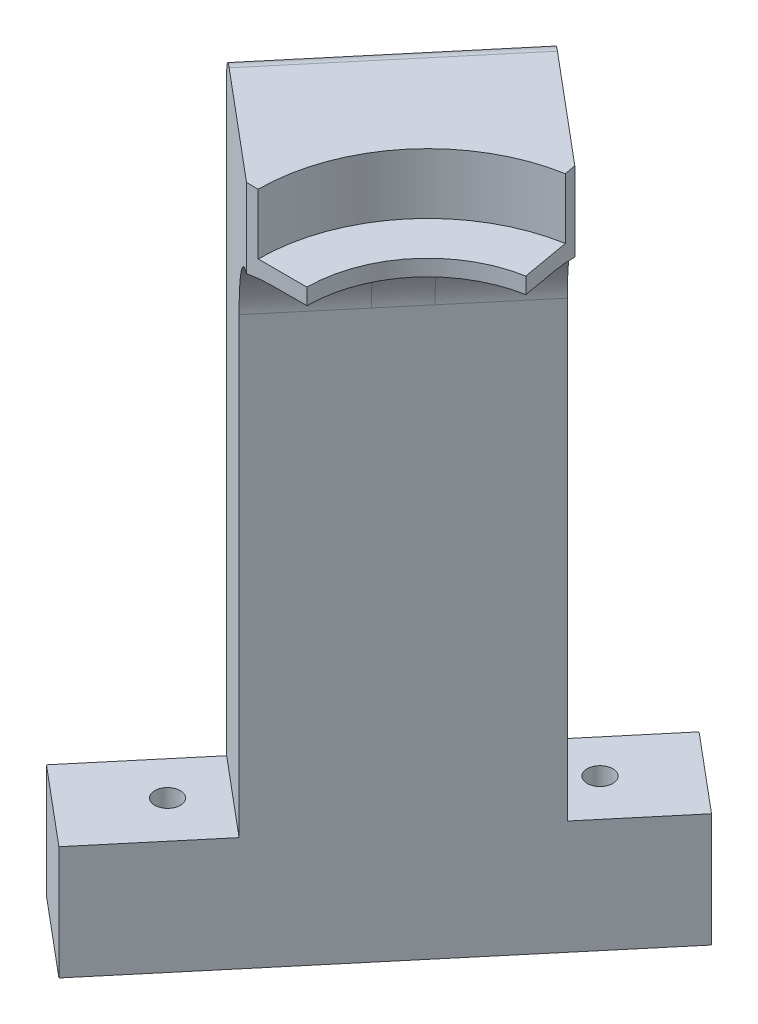
ISO-10303-21;
HEADER;
FILE_DESCRIPTION(('STEP AP214'),'2;1');
FILE_NAME('part.step','',(''),(''),'','','');
FILE_SCHEMA(('AUTOMOTIVE_DESIGN { 1 0 10303 214 1 1 1 1 }'));
ENDSEC;
DATA;
#1=APPLICATION_CONTEXT('core data for automotive mechanical design processes');
#2=APPLICATION_PROTOCOL_DEFINITION('international standard','automotive_design',2000,#1);
#3=PRODUCT_CONTEXT('',#1,'mechanical');
#4=PRODUCT('Part','Part','',(#3));
#5=PRODUCT_RELATED_PRODUCT_CATEGORY('part','',(#4));
#6=PRODUCT_DEFINITION_FORMATION('','',#4);
#7=PRODUCT_DEFINITION_CONTEXT('part definition',#1,'design');
#8=PRODUCT_DEFINITION('design','',#6,#7);
#9=PRODUCT_DEFINITION_SHAPE('','',#8);
#10=(LENGTH_UNIT() NAMED_UNIT(*) SI_UNIT(.MILLI.,.METRE.));
#11=(NAMED_UNIT(*) PLANE_ANGLE_UNIT() SI_UNIT($,.RADIAN.));
#12=(NAMED_UNIT(*) SI_UNIT($,.STERADIAN.) SOLID_ANGLE_UNIT());
#13=UNCERTAINTY_MEASURE_WITH_UNIT(LENGTH_MEASURE(1.E-05),#10,'distance_accuracy_value','');
#14=(GEOMETRIC_REPRESENTATION_CONTEXT(3) GLOBAL_UNCERTAINTY_ASSIGNED_CONTEXT((#13)) GLOBAL_UNIT_ASSIGNED_CONTEXT((#10,
#11,#12)) REPRESENTATION_CONTEXT('',''));
#15=CARTESIAN_POINT('',(0.,0.,0.));
#16=DIRECTION('',(0.,0.,1.));
#17=DIRECTION('',(1.,0.,0.));
#18=AXIS2_PLACEMENT_3D('',#15,#16,#17);
#19=CARTESIAN_POINT('',(34.9197212885323,0.,-41.6157032979967));
#20=DIRECTION('',(-0.642787609686541,0.,0.766044443118976));
#21=DIRECTION('',(0.766044443118976,0.,0.642787609686541));
#22=AXIS2_PLACEMENT_3D('',#19,#20,#21);
#23=PLANE('',#22);
#24=DIRECTION('',(-0.766044443118976,0.,-0.642787609686541));
#25=VECTOR('',#24,1.);
#26=CARTESIAN_POINT('',(-2.97802935575824,-132.425,-73.4156918860695));
#27=LINE('',#26,#25);
#28=CARTESIAN_POINT('',(-2.97802935575824,-132.425,-73.4156918860695));
#29=VERTEX_POINT('',#28);
#30=CARTESIAN_POINT('',(-22.1291404337327,-132.425,-89.4853821282331));
#31=VERTEX_POINT('',#30);
#32=EDGE_CURVE('E198',#29,#31,#27,.T.);
#33=ORIENTED_EDGE('',*,*,#32,.F.);
#34=DIRECTION('',(0.,-1.,0.));
#35=VECTOR('',#34,1.);
#36=CARTESIAN_POINT('',(-2.97802935575824,-103.5,-73.4156918860695));
#37=LINE('',#36,#35);
#38=CARTESIAN_POINT('',(-2.97802935575824,-160.65,-73.4156918860695));
#39=VERTEX_POINT('',#38);
#40=EDGE_CURVE('E250',#29,#39,#37,.T.);
#41=ORIENTED_EDGE('',*,*,#40,.T.);
#42=DIRECTION('',(0.766044443118976,0.,0.642787609686541));
#43=VECTOR('',#42,1.);
#44=CARTESIAN_POINT('',(-22.1291404337327,-160.65,-89.4853821282331));
#45=LINE('',#44,#43);
#46=CARTESIAN_POINT('',(-22.1291404337327,-160.65,-89.4853821282331));
#47=VERTEX_POINT('',#46);
#48=EDGE_CURVE('E236',#47,#39,#45,.T.);
#49=ORIENTED_EDGE('',*,*,#48,.F.);
#50=DIRECTION('',(0.,1.,0.));
#51=VECTOR('',#50,1.);
#52=CARTESIAN_POINT('',(-22.1291404337327,-103.5,-89.4853821282331));
#53=LINE('',#52,#51);
#54=EDGE_CURVE('E253',#47,#31,#53,.T.);
#55=ORIENTED_EDGE('',*,*,#54,.T.);
#56=EDGE_LOOP('',(#33,#41,#49,#55));
#57=FACE_BOUND('',#56,.T.);
#58=ADVANCED_FACE('F43',(#57),#23,.F.);
#59=CARTESIAN_POINT('',(-39.0014226100418,0.,46.4800855118022));
#60=DIRECTION('',(-0.642787609686541,0.,0.766044443118977));
#61=DIRECTION('',(0.766044443118977,0.,0.642787609686541));
#62=AXIS2_PLACEMENT_3D('',#59,#60,#61);
#63=PLANE('',#62);
#64=DIRECTION('',(0.,1.,0.));
#65=VECTOR('',#64,1.);
#66=CARTESIAN_POINT('',(-76.8991732543323,-103.5,14.6800969237294));
#67=LINE('',#66,#65);
#68=CARTESIAN_POINT('',(-76.8991732543323,-160.65,14.6800969237294));
#69=VERTEX_POINT('',#68);
#70=CARTESIAN_POINT('',(-76.8991732543323,-132.425,14.6800969237294));
#71=VERTEX_POINT('',#70);
#72=EDGE_CURVE('E247',#69,#71,#67,.T.);
#73=ORIENTED_EDGE('',*,*,#72,.T.);
#74=DIRECTION('',(0.766044443118977,0.,0.642787609686541));
#75=VECTOR('',#74,1.);
#76=CARTESIAN_POINT('',(-96.0502843323067,-132.425,-1.38959331843411));
#77=LINE('',#76,#75);
#78=CARTESIAN_POINT('',(-96.0502843323067,-132.425,-1.38959331843411));
#79=VERTEX_POINT('',#78);
#80=EDGE_CURVE('E192',#79,#71,#77,.T.);
#81=ORIENTED_EDGE('',*,*,#80,.F.);
#82=DIRECTION('',(0.,-1.,0.));
#83=VECTOR('',#82,1.);
#84=CARTESIAN_POINT('',(-96.0502843323067,-97.5,-1.38959331843411));
#85=LINE('',#84,#83);
#86=CARTESIAN_POINT('',(-96.0502843323067,-160.65,-1.38959331843411));
#87=VERTEX_POINT('',#86);
#88=EDGE_CURVE('E244',#79,#87,#85,.T.);
#89=ORIENTED_EDGE('',*,*,#88,.T.);
#90=DIRECTION('',(-0.766044443118977,0.,-0.642787609686541));
#91=VECTOR('',#90,1.);
#92=CARTESIAN_POINT('',(-76.8991732543323,-160.65,14.6800969237294));
#93=LINE('',#92,#91);
#94=EDGE_CURVE('E228',#69,#87,#93,.T.);
#95=ORIENTED_EDGE('',*,*,#94,.F.);
#96=EDGE_LOOP('',(#73,#81,#89,#95));
#97=FACE_BOUND('',#96,.T.);
#98=ADVANCED_FACE('F389',(#97),#63,.T.);
#99=CARTESIAN_POINT('',(-73.8894813564539,-78.1,-9.29198815349686));
#100=DIRECTION('',(0.,-1.,0.));
#101=DIRECTION('',(0.,0.,-1.));
#102=AXIS2_PLACEMENT_3D('',#99,#100,#101);
#103=CYLINDRICAL_SURFACE('',#102,3.175);
#104=CARTESIAN_POINT('',(-73.8894813564539,-160.65,-9.29198815349686));
#105=DIRECTION('',(0.,-1.,0.));
#106=DIRECTION('',(0.,0.,-1.));
#107=AXIS2_PLACEMENT_3D('',#104,#105,#106);
#108=CIRCLE('',#107,3.175);
#109=CARTESIAN_POINT('',(-73.8894813564539,-160.65,-12.4669881534969));
#110=VERTEX_POINT('',#109);
#111=EDGE_CURVE('E205',#110,#110,#108,.T.);
#112=ORIENTED_EDGE('',*,*,#111,.T.);
#113=EDGE_LOOP('',(#112));
#114=FACE_BOUND('',#113,.T.);
#115=CARTESIAN_POINT('',(-73.8894813564539,-132.425,-9.29198815349686));
#116=DIRECTION('',(0.,1.,0.));
#117=DIRECTION('',(0.,0.,1.));
#118=AXIS2_PLACEMENT_3D('',#115,#116,#117);
#119=CIRCLE('',#118,3.175);
#120=CARTESIAN_POINT('',(-73.8894813564539,-132.425,-6.11698815349686));
#121=VERTEX_POINT('',#120);
#122=EDGE_CURVE('E194',#121,#121,#119,.T.);
#123=ORIENTED_EDGE('',*,*,#122,.T.);
#124=EDGE_LOOP('',(#123));
#125=FACE_BOUND('',#124,.T.);
#126=ADVANCED_FACE('F395',(#114,#125),#103,.F.);
#127=CARTESIAN_POINT('',(-24.9090654983395,-78.1,-67.6645747191629));
#128=DIRECTION('',(0.,-1.,0.));
#129=DIRECTION('',(0.,0.,-1.));
#130=AXIS2_PLACEMENT_3D('',#127,#128,#129);
#131=CYLINDRICAL_SURFACE('',#130,3.175);
#132=CARTESIAN_POINT('',(-24.9090654983395,-160.65,-67.6645747191629));
#133=DIRECTION('',(0.,-1.,0.));
#134=DIRECTION('',(0.,0.,-1.));
#135=AXIS2_PLACEMENT_3D('',#132,#133,#134);
#136=CIRCLE('',#135,3.175);
#137=CARTESIAN_POINT('',(-24.9090654983395,-160.65,-70.8395747191629));
#138=VERTEX_POINT('',#137);
#139=EDGE_CURVE('E224',#138,#138,#136,.T.);
#140=ORIENTED_EDGE('',*,*,#139,.T.);
#141=EDGE_LOOP('',(#140));
#142=FACE_BOUND('',#141,.T.);
#143=CARTESIAN_POINT('',(-24.9090654983395,-132.425,-67.6645747191629));
#144=DIRECTION('',(0.,1.,0.));
#145=DIRECTION('',(0.,0.,1.));
#146=AXIS2_PLACEMENT_3D('',#143,#144,#145);
#147=CIRCLE('',#146,3.175);
#148=CARTESIAN_POINT('',(-24.9090654983395,-132.425,-64.4895747191629));
#149=VERTEX_POINT('',#148);
#150=EDGE_CURVE('E206',#149,#149,#147,.T.);
#151=ORIENTED_EDGE('',*,*,#150,.T.);
#152=EDGE_LOOP('',(#151));
#153=FACE_BOUND('',#152,.T.);
#154=ADVANCED_FACE('F560',(#142,#153),#131,.F.);
#155=CARTESIAN_POINT('',(0.,0.,0.));
#156=DIRECTION('',(0.,1.,0.));
#157=DIRECTION('',(0.,0.,1.));
#158=AXIS2_PLACEMENT_3D('',#155,#156,#157);
#159=PLANE('',#158);
#160=DIRECTION('',(-1.,0.,0.));
#161=VECTOR('',#160,1.);
#162=CARTESIAN_POINT('',(0.,0.,0.));
#163=LINE('',#162,#161);
#164=CARTESIAN_POINT('',(-30.,0.,0.));
#165=VERTEX_POINT('',#164);
#166=CARTESIAN_POINT('',(-38.4729635533386,0.,0.));
#167=VERTEX_POINT('',#166);
#168=EDGE_CURVE('E301',#165,#167,#163,.T.);
#169=ORIENTED_EDGE('',*,*,#168,.T.);
#170=DIRECTION('',(-0.642787609686541,0.,0.766044443118977));
#171=VECTOR('',#170,1.);
#172=CARTESIAN_POINT('',(-3.98394577941684,0.,-41.1024108371167));
#173=LINE('',#172,#171);
#174=CARTESIAN_POINT('',(-26.1788372794916,0.,-14.651569154664));
#175=VERTEX_POINT('',#174);
#176=EDGE_CURVE('E444',#167,#175,#173,.F.);
#177=ORIENTED_EDGE('',*,*,#176,.T.);
#178=CARTESIAN_POINT('',(0.,0.,0.));
#179=DIRECTION('',(0.,1.,0.));
#180=DIRECTION('',(0.,0.,1.));
#181=AXIS2_PLACEMENT_3D('',#178,#179,#180);
#182=CIRCLE('',#181,30.);
#183=EDGE_CURVE('E295',#175,#165,#182,.T.);
#184=ORIENTED_EDGE('',*,*,#183,.T.);
#185=EDGE_LOOP('',(#169,#177,#184));
#186=FACE_BOUND('',#185,.T.);
#187=ADVANCED_FACE('F469',(#186),#159,.F.);
#188=CARTESIAN_POINT('',(-5.20944533000783,0.,-29.5442325903663));
#189=VERTEX_POINT('',#188);
#190=CARTESIAN_POINT('',(-18.9748862843304,0.,-23.23690363402));
#191=VERTEX_POINT('',#190);
#192=EDGE_CURVE('E310',#189,#191,#182,.T.);
#193=ORIENTED_EDGE('',*,*,#192,.T.);
#194=DIRECTION('',(-0.642787609686541,0.,0.766044443118977));
#195=VECTOR('',#194,1.);
#196=CARTESIAN_POINT('',(-3.98394577941684,0.,-41.1024108371167));
#197=LINE('',#196,#195);
#198=CARTESIAN_POINT('',(-6.68076001048337,0.,-37.888472788684));
#199=VERTEX_POINT('',#198);
#200=EDGE_CURVE('E451',#191,#199,#197,.F.);
#201=ORIENTED_EDGE('',*,*,#200,.T.);
#202=DIRECTION('',(-0.173648177666928,0.,-0.984807753012209));
#203=VECTOR('',#202,1.);
#204=CARTESIAN_POINT('',(0.,0.,0.));
#205=LINE('',#204,#203);
#206=EDGE_CURVE('E314',#189,#199,#205,.T.);
#207=ORIENTED_EDGE('',*,*,#206,.F.);
#208=EDGE_LOOP('',(#193,#201,#207));
#209=FACE_BOUND('',#208,.T.);
#210=ADVANCED_FACE('F463',(#209),#159,.F.);
#211=CARTESIAN_POINT('',(0.,4.,0.));
#212=DIRECTION('',(0.,1.,0.));
#213=DIRECTION('',(0.,0.,1.));
#214=AXIS2_PLACEMENT_3D('',#211,#212,#213);
#215=PLANE('',#214);
#216=DIRECTION('',(-0.173648177666928,0.,-0.984807753012209));
#217=VECTOR('',#216,1.);
#218=CARTESIAN_POINT('',(0.,4.,0.));
#219=LINE('',#218,#217);
#220=CARTESIAN_POINT('',(-5.20944533000783,4.,-29.5442325903663));
#221=VERTEX_POINT('',#220);
#222=CARTESIAN_POINT('',(-7.31058827977765,4.,-41.460406401814));
#223=VERTEX_POINT('',#222);
#224=EDGE_CURVE('E300',#221,#223,#219,.T.);
#225=ORIENTED_EDGE('',*,*,#224,.T.);
#226=CARTESIAN_POINT('',(0.,4.,0.));
#227=DIRECTION('',(0.,1.,0.));
#228=DIRECTION('',(0.,0.,1.));
#229=AXIS2_PLACEMENT_3D('',#226,#227,#228);
#230=CIRCLE('',#229,42.1);
#231=CARTESIAN_POINT('',(-42.1,4.,0.));
#232=VERTEX_POINT('',#231);
#233=EDGE_CURVE('E292',#232,#223,#230,.F.);
#234=ORIENTED_EDGE('',*,*,#233,.F.);
#235=DIRECTION('',(-1.,0.,0.));
#236=VECTOR('',#235,1.);
#237=CARTESIAN_POINT('',(0.,4.,0.));
#238=LINE('',#237,#236);
#239=CARTESIAN_POINT('',(-30.,4.,0.));
#240=VERTEX_POINT('',#239);
#241=EDGE_CURVE('E305',#240,#232,#238,.T.);
#242=ORIENTED_EDGE('',*,*,#241,.F.);
#243=CARTESIAN_POINT('',(0.,4.,0.));
#244=DIRECTION('',(0.,1.,0.));
#245=DIRECTION('',(0.,0.,1.));
#246=AXIS2_PLACEMENT_3D('',#243,#244,#245);
#247=CIRCLE('',#246,30.);
#248=EDGE_CURVE('E296',#221,#240,#247,.T.);
#249=ORIENTED_EDGE('',*,*,#248,.F.);
#250=EDGE_LOOP('',(#225,#234,#242,#249));
#251=FACE_BOUND('',#250,.T.);
#252=ADVANCED_FACE('F479',(#251),#215,.T.);
#253=CARTESIAN_POINT('',(0.,4.,0.));
#254=DIRECTION('',(0.,-1.,0.));
#255=DIRECTION('',(0.,0.,-1.));
#256=AXIS2_PLACEMENT_3D('',#253,#254,#255);
#257=CYLINDRICAL_SURFACE('',#256,30.);
#258=ORIENTED_EDGE('',*,*,#192,.F.);
#259=DIRECTION('',(0.,-1.,0.));
#260=VECTOR('',#259,1.);
#261=CARTESIAN_POINT('',(-5.20944533000783,4.,-29.5442325903663));
#262=LINE('',#261,#260);
#263=EDGE_CURVE('E331',#221,#189,#262,.T.);
#264=ORIENTED_EDGE('',*,*,#263,.F.);
#265=ORIENTED_EDGE('',*,*,#248,.T.);
#266=DIRECTION('',(0.,-1.,0.));
#267=VECTOR('',#266,1.);
#268=CARTESIAN_POINT('',(-30.,4.,0.));
#269=LINE('',#268,#267);
#270=EDGE_CURVE('E309',#240,#165,#269,.T.);
#271=ORIENTED_EDGE('',*,*,#270,.T.);
#272=ORIENTED_EDGE('',*,*,#183,.F.);
#273=EDGE_CURVE('E315',#191,#175,#182,.T.);
#274=ORIENTED_EDGE('',*,*,#273,.F.);
#275=EDGE_LOOP('',(#258,#264,#265,#271,#272,#274));
#276=FACE_BOUND('',#275,.T.);
#277=ADVANCED_FACE('F354',(#276),#257,.F.);
#278=CARTESIAN_POINT('',(0.,4.,0.));
#279=DIRECTION('',(-0.984807753012209,0.,0.173648177666928));
#280=DIRECTION('',(0.173648177666928,0.,0.984807753012209));
#281=AXIS2_PLACEMENT_3D('',#278,#279,#280);
#282=PLANE('',#281);
#283=DIRECTION('',(0.,-1.,0.));
#284=VECTOR('',#283,1.);
#285=CARTESIAN_POINT('',(-7.31058827977765,14.,-41.460406401814));
#286=LINE('',#285,#284);
#287=CARTESIAN_POINT('',(-7.31058827977764,19.,-41.460406401814));
#288=VERTEX_POINT('',#287);
#289=EDGE_CURVE('E284',#288,#223,#286,.T.);
#290=ORIENTED_EDGE('',*,*,#289,.T.);
#291=ORIENTED_EDGE('',*,*,#224,.F.);
#292=ORIENTED_EDGE('',*,*,#263,.T.);
#293=ORIENTED_EDGE('',*,*,#206,.T.);
#294=CARTESIAN_POINT('',(-6.68076001048337,-20.,-37.888472788684));
#295=DIRECTION('',(-0.984807753012209,0.,0.173648177666928));
#296=DIRECTION('',(-0.173648177666928,0.,-0.984807753012209));
#297=AXIS2_PLACEMENT_3D('',#294,#295,#296);
#298=ELLIPSE('',#297,26.1081457866456,20.);
#299=CARTESIAN_POINT('',(-7.81416799501174,-0.635083268962916,-44.3163488855494));
#300=VERTEX_POINT('',#299);
#301=EDGE_CURVE('E424',#199,#300,#298,.T.);
#302=ORIENTED_EDGE('',*,*,#301,.T.);
#303=DIRECTION('',(0.,-1.,0.));
#304=VECTOR('',#303,1.);
#305=CARTESIAN_POINT('',(-7.81416799501174,4.,-44.3163488855494));
#306=LINE('',#305,#304);
#307=CARTESIAN_POINT('',(-7.81416799501175,19.,-44.3163488855494));
#308=VERTEX_POINT('',#307);
#309=EDGE_CURVE('E328',#308,#300,#306,.T.);
#310=ORIENTED_EDGE('',*,*,#309,.F.);
#311=DIRECTION('',(-0.173648177666927,0.,-0.984807753012209));
#312=VECTOR('',#311,1.);
#313=CARTESIAN_POINT('',(0.,19.,0.));
#314=LINE('',#313,#312);
#315=EDGE_CURVE('E268',#288,#308,#314,.T.);
#316=ORIENTED_EDGE('',*,*,#315,.F.);
#317=EDGE_LOOP('',(#290,#291,#292,#293,#302,#310,#316));
#318=FACE_BOUND('',#317,.T.);
#319=ADVANCED_FACE('F460',(#318),#282,.F.);
#320=CARTESIAN_POINT('',(0.,4.,0.));
#321=DIRECTION('',(0.,0.,1.));
#322=DIRECTION('',(1.,0.,0.));
#323=AXIS2_PLACEMENT_3D('',#320,#321,#322);
#324=PLANE('',#323);
#325=DIRECTION('',(0.,-1.,0.));
#326=VECTOR('',#325,1.);
#327=CARTESIAN_POINT('',(-45.,4.,0.));
#328=LINE('',#327,#326);
#329=CARTESIAN_POINT('',(-45.,19.,0.));
#330=VERTEX_POINT('',#329);
#331=CARTESIAN_POINT('',(-45.,-0.635083268962916,0.));
#332=VERTEX_POINT('',#331);
#333=EDGE_CURVE('E325',#330,#332,#328,.T.);
#334=ORIENTED_EDGE('',*,*,#333,.T.);
#335=CARTESIAN_POINT('',(-38.4729635533386,-20.,0.));
#336=DIRECTION('',(0.,0.,1.));
#337=DIRECTION('',(1.,0.,0.));
#338=AXIS2_PLACEMENT_3D('',#335,#336,#337);
#339=ELLIPSE('',#338,26.1081457866456,20.);
#340=EDGE_CURVE('E430',#332,#167,#339,.F.);
#341=ORIENTED_EDGE('',*,*,#340,.T.);
#342=ORIENTED_EDGE('',*,*,#168,.F.);
#343=ORIENTED_EDGE('',*,*,#270,.F.);
#344=ORIENTED_EDGE('',*,*,#241,.T.);
#345=DIRECTION('',(0.,-1.,0.));
#346=VECTOR('',#345,1.);
#347=CARTESIAN_POINT('',(-42.1,14.,0.));
#348=LINE('',#347,#346);
#349=CARTESIAN_POINT('',(-42.1,19.,0.));
#350=VERTEX_POINT('',#349);
#351=EDGE_CURVE('E288',#350,#232,#348,.T.);
#352=ORIENTED_EDGE('',*,*,#351,.F.);
#353=DIRECTION('',(1.,0.,0.));
#354=VECTOR('',#353,1.);
#355=CARTESIAN_POINT('',(0.,19.,0.));
#356=LINE('',#355,#354);
#357=EDGE_CURVE('E260',#330,#350,#356,.T.);
#358=ORIENTED_EDGE('',*,*,#357,.F.);
#359=EDGE_LOOP('',(#334,#341,#342,#343,#344,#352,#358));
#360=FACE_BOUND('',#359,.T.);
#361=ADVANCED_FACE('F474',(#360),#324,.T.);
#362=CARTESIAN_POINT('',(0.,14.,0.));
#363=DIRECTION('',(0.,-1.,0.));
#364=DIRECTION('',(0.,0.,-1.));
#365=AXIS2_PLACEMENT_3D('',#362,#363,#364);
#366=CYLINDRICAL_SURFACE('',#365,42.1);
#367=ORIENTED_EDGE('',*,*,#351,.T.);
#368=ORIENTED_EDGE('',*,*,#233,.T.);
#369=ORIENTED_EDGE('',*,*,#289,.F.);
#370=CARTESIAN_POINT('',(0.,19.,0.));
#371=DIRECTION('',(0.,1.,0.));
#372=DIRECTION('',(0.,0.,1.));
#373=AXIS2_PLACEMENT_3D('',#370,#371,#372);
#374=CIRCLE('',#373,42.1);
#375=EDGE_CURVE('E264',#288,#350,#374,.T.);
#376=ORIENTED_EDGE('',*,*,#375,.T.);
#377=EDGE_LOOP('',(#367,#368,#369,#376));
#378=FACE_BOUND('',#377,.T.);
#379=ADVANCED_FACE('F477',(#378),#366,.F.);
#380=CARTESIAN_POINT('',(-38.4559457197708,101.490947660166,-70.027853273011));
#381=DIRECTION('',(0.642787609686541,0.,-0.766044443118977));
#382=DIRECTION('',(-0.766044443118976,0.,-0.642787609686541));
#383=AXIS2_PLACEMENT_3D('',#380,#381,#382);
#384=PLANE('',#383);
#385=DIRECTION('',(0.,1.,0.));
#386=VECTOR('',#385,1.);
#387=CARTESIAN_POINT('',(-19.3048346417964,-103.5,-53.9581630308475));
#388=LINE('',#387,#386);
#389=CARTESIAN_POINT('',(-19.3048346417964,-132.425,-53.9581630308475));
#390=VERTEX_POINT('',#389);
#391=CARTESIAN_POINT('',(-19.3048346417964,-20.,-53.9581630308475));
#392=VERTEX_POINT('',#391);
#393=EDGE_CURVE('E182',#390,#392,#388,.T.);
#394=ORIENTED_EDGE('',*,*,#393,.F.);
#395=DIRECTION('',(0.766044443118977,0.,0.642787609686541));
#396=VECTOR('',#395,1.);
#397=CARTESIAN_POINT('',(-38.4559457197708,-132.425,-70.027853273011));
#398=LINE('',#397,#396);
#399=CARTESIAN_POINT('',(-38.4559457197708,-132.425,-70.027853273011));
#400=VERTEX_POINT('',#399);
#401=EDGE_CURVE('E214',#400,#390,#398,.T.);
#402=ORIENTED_EDGE('',*,*,#401,.F.);
#403=DIRECTION('',(0.,-1.,0.));
#404=VECTOR('',#403,1.);
#405=CARTESIAN_POINT('',(-38.4559457197708,101.490947660166,-70.027853273011));
#406=LINE('',#405,#404);
#407=CARTESIAN_POINT('',(-38.4559457197708,14.,-70.027853273011));
#408=VERTEX_POINT('',#407);
#409=EDGE_CURVE('E281',#408,#400,#406,.T.);
#410=ORIENTED_EDGE('',*,*,#409,.F.);
#411=CARTESIAN_POINT('',(-34.6257235041759,14.,-66.8139152245783));
#412=DIRECTION('',(0.642787609686541,0.,-0.766044443118977));
#413=DIRECTION('',(-0.766044443118976,0.,-0.642787609686541));
#414=AXIS2_PLACEMENT_3D('',#411,#412,#413);
#415=CIRCLE('',#414,5.);
#416=CARTESIAN_POINT('',(-34.6257235041759,19.,-66.8139152245783));
#417=VERTEX_POINT('',#416);
#418=EDGE_CURVE('E11',#408,#417,#415,.T.);
#419=ORIENTED_EDGE('',*,*,#418,.T.);
#420=DIRECTION('',(-0.766044443118977,0.,-0.642787609686541));
#421=VECTOR('',#420,1.);
#422=CARTESIAN_POINT('',(18.5929160024941,19.,-22.1581744427747));
#423=LINE('',#422,#421);
#424=EDGE_CURVE('E272',#308,#417,#423,.T.);
#425=ORIENTED_EDGE('',*,*,#424,.F.);
#426=ORIENTED_EDGE('',*,*,#309,.T.);
#427=CARTESIAN_POINT('',(-3.98394577941685,-20.,-41.1024108371167));
#428=DIRECTION('',(0.642787609686541,0.,-0.766044443118977));
#429=DIRECTION('',(-0.766044443118976,0.,-0.642787609686541));
#430=AXIS2_PLACEMENT_3D('',#427,#428,#429);
#431=CIRCLE('',#430,20.);
#432=EDGE_CURVE('E420',#300,#392,#431,.F.);
#433=ORIENTED_EDGE('',*,*,#432,.T.);
#434=EDGE_LOOP('',(#394,#402,#410,#419,#425,#426,#433));
#435=FACE_BOUND('',#434,.T.);
#436=ADVANCED_FACE('F507',(#435),#384,.T.);
#437=CARTESIAN_POINT('',(-45.,101.490947660166,0.));
#438=DIRECTION('',(-0.642787609686541,0.,0.766044443118977));
#439=DIRECTION('',(0.766044443118977,0.,0.642787609686541));
#440=AXIS2_PLACEMENT_3D('',#437,#438,#439);
#441=PLANE('',#440);
#442=DIRECTION('',(0.,-1.,0.));
#443=VECTOR('',#442,1.);
#444=CARTESIAN_POINT('',(-75.6417777247591,101.490947660166,-25.7115043874616));
#445=LINE('',#444,#443);
#446=CARTESIAN_POINT('',(-75.6417777247591,14.,-25.7115043874616));
#447=VERTEX_POINT('',#446);
#448=CARTESIAN_POINT('',(-75.6417777247591,-132.425,-25.7115043874616));
#449=VERTEX_POINT('',#448);
#450=EDGE_CURVE('E188',#447,#449,#445,.T.);
#451=ORIENTED_EDGE('',*,*,#450,.T.);
#452=DIRECTION('',(-0.766044443118977,0.,-0.64278760968654));
#453=VECTOR('',#452,1.);
#454=CARTESIAN_POINT('',(-56.4906666467847,-132.425,-9.64181414529812));
#455=LINE('',#454,#453);
#456=CARTESIAN_POINT('',(-56.4906666467847,-132.425,-9.64181414529812));
#457=VERTEX_POINT('',#456);
#458=EDGE_CURVE('E185',#457,#449,#455,.T.);
#459=ORIENTED_EDGE('',*,*,#458,.F.);
#460=DIRECTION('',(0.,1.,0.));
#461=VECTOR('',#460,1.);
#462=CARTESIAN_POINT('',(-56.4906666467847,-103.5,-9.64181414529812));
#463=LINE('',#462,#461);
#464=CARTESIAN_POINT('',(-56.4906666467847,-20.,-9.64181414529812));
#465=VERTEX_POINT('',#464);
#466=EDGE_CURVE('E170',#457,#465,#463,.T.);
#467=ORIENTED_EDGE('',*,*,#466,.T.);
#468=CARTESIAN_POINT('',(-41.1697777844051,-20.,3.21393804843269));
#469=DIRECTION('',(-0.642787609686541,0.,0.766044443118977));
#470=DIRECTION('',(0.766044443118977,0.,0.642787609686541));
#471=AXIS2_PLACEMENT_3D('',#468,#469,#470);
#472=CIRCLE('',#471,20.);
#473=EDGE_CURVE('E445',#465,#332,#472,.F.);
#474=ORIENTED_EDGE('',*,*,#473,.T.);
#475=ORIENTED_EDGE('',*,*,#333,.F.);
#476=DIRECTION('',(0.766044443118977,0.,0.642787609686541));
#477=VECTOR('',#476,1.);
#478=CARTESIAN_POINT('',(-18.5929160024941,19.,22.1581744427747));
#479=LINE('',#478,#477);
#480=CARTESIAN_POINT('',(-71.8115555091642,19.,-22.4975663390289));
#481=VERTEX_POINT('',#480);
#482=EDGE_CURVE('E257',#481,#330,#479,.T.);
#483=ORIENTED_EDGE('',*,*,#482,.F.);
#484=CARTESIAN_POINT('',(-71.8115555091642,14.,-22.4975663390289));
#485=DIRECTION('',(-0.642787609686541,0.,0.766044443118977));
#486=DIRECTION('',(0.766044443118977,0.,0.642787609686541));
#487=AXIS2_PLACEMENT_3D('',#484,#485,#486);
#488=CIRCLE('',#487,5.);
#489=EDGE_CURVE('E418',#481,#447,#488,.T.);
#490=ORIENTED_EDGE('',*,*,#489,.T.);
#491=EDGE_LOOP('',(#451,#459,#467,#474,#475,#483,#490));
#492=FACE_BOUND('',#491,.T.);
#493=ADVANCED_FACE('F186',(#492),#441,.T.);
#494=CARTESIAN_POINT('',(-75.6417777247591,101.490947660166,-25.7115043874616));
#495=DIRECTION('',(-0.766044443118977,0.,-0.642787609686541));
#496=DIRECTION('',(-0.642787609686541,0.,0.766044443118977));
#497=AXIS2_PLACEMENT_3D('',#494,#495,#496);
#498=PLANE('',#497);
#499=DIRECTION('',(-0.64278760968654,0.,0.766044443118977));
#500=VECTOR('',#499,1.);
#501=CARTESIAN_POINT('',(-75.6417777247591,-132.425,-25.7115043874616));
#502=LINE('',#501,#500);
#503=EDGE_CURVE('E67',#449,#79,#502,.T.);
#504=ORIENTED_EDGE('',*,*,#503,.F.);
#505=ORIENTED_EDGE('',*,*,#450,.F.);
#506=DIRECTION('',(-0.642787609686541,0.,0.766044443118977));
#507=VECTOR('',#506,1.);
#508=CARTESIAN_POINT('',(-75.6417777247591,14.,-25.7115043874616));
#509=LINE('',#508,#507);
#510=EDGE_CURVE('E52',#447,#408,#509,.F.);
#511=ORIENTED_EDGE('',*,*,#510,.T.);
#512=ORIENTED_EDGE('',*,*,#409,.T.);
#513=DIRECTION('',(-0.642787609686541,0.,0.766044443118977));
#514=VECTOR('',#513,1.);
#515=CARTESIAN_POINT('',(-22.1291404337327,-132.425,-89.4853821282331));
#516=LINE('',#515,#514);
#517=EDGE_CURVE('E210',#31,#400,#516,.T.);
#518=ORIENTED_EDGE('',*,*,#517,.F.);
#519=ORIENTED_EDGE('',*,*,#54,.F.);
#520=DIRECTION('',(0.642787609686541,0.,-0.766044443118977));
#521=VECTOR('',#520,1.);
#522=CARTESIAN_POINT('',(-96.0502843323067,-160.65,-1.38959331843411));
#523=LINE('',#522,#521);
#524=EDGE_CURVE('E232',#87,#47,#523,.T.);
#525=ORIENTED_EDGE('',*,*,#524,.F.);
#526=ORIENTED_EDGE('',*,*,#88,.F.);
#527=EDGE_LOOP('',(#504,#505,#511,#512,#518,#519,#525,#526));
#528=FACE_BOUND('',#527,.T.);
#529=ADVANCED_FACE('F387',(#528),#498,.T.);
#530=CARTESIAN_POINT('',(-19.3048346417964,-103.5,-53.9581630308475));
#531=DIRECTION('',(-0.766044443118977,0.,-0.642787609686541));
#532=DIRECTION('',(-0.642787609686541,0.,0.766044443118977));
#533=AXIS2_PLACEMENT_3D('',#530,#531,#532);
#534=PLANE('',#533);
#535=ORIENTED_EDGE('',*,*,#466,.F.);
#536=DIRECTION('',(0.64278760968654,0.,-0.766044443118977));
#537=VECTOR('',#536,1.);
#538=CARTESIAN_POINT('',(-76.8991732543323,-132.425,14.6800969237294));
#539=LINE('',#538,#537);
#540=EDGE_CURVE('E174',#71,#457,#539,.T.);
#541=ORIENTED_EDGE('',*,*,#540,.F.);
#542=ORIENTED_EDGE('',*,*,#72,.F.);
#543=DIRECTION('',(-0.642787609686541,0.,0.766044443118977));
#544=VECTOR('',#543,1.);
#545=CARTESIAN_POINT('',(-2.97802935575824,-160.65,-73.4156918860695));
#546=LINE('',#545,#544);
#547=EDGE_CURVE('E240',#39,#69,#546,.T.);
#548=ORIENTED_EDGE('',*,*,#547,.F.);
#549=ORIENTED_EDGE('',*,*,#40,.F.);
#550=DIRECTION('',(0.642787609686541,0.,-0.766044443118976));
#551=VECTOR('',#550,1.);
#552=CARTESIAN_POINT('',(-19.3048346417964,-132.425,-53.9581630308475));
#553=LINE('',#552,#551);
#554=EDGE_CURVE('E59',#390,#29,#553,.T.);
#555=ORIENTED_EDGE('',*,*,#554,.F.);
#556=ORIENTED_EDGE('',*,*,#393,.T.);
#557=DIRECTION('',(-0.642787609686541,0.,0.766044443118977));
#558=VECTOR('',#557,1.);
#559=CARTESIAN_POINT('',(-56.4906666467847,-20.,-9.64181414529812));
#560=LINE('',#559,#558);
#561=CARTESIAN_POINT('',(-34.2957751467099,-20.,-36.0926558277508));
#562=VERTEX_POINT('',#561);
#563=EDGE_CURVE('E345',#392,#562,#560,.T.);
#564=ORIENTED_EDGE('',*,*,#563,.T.);
#565=CARTESIAN_POINT('',(-22.1201176626565,-18.1713531483921,-50.6030393765679));
#566=CARTESIAN_POINT('',(-27.1816429716414,8.59026196425348,-44.5709484055788));
#567=CARTESIAN_POINT('',(-5.31816404289481,0.,-29.5248561590545));
#568=CARTESIAN_POINT('',(-22.3583721583751,-18.2804174886329,-50.3190987253436));
#569=CARTESIAN_POINT('',(-27.1779082997154,8.36205599485056,-44.5753992142637));
#570=CARTESIAN_POINT('',(-5.53739226825397,0.,-29.485361211326));
#571=CARTESIAN_POINT('',(-22.5978403334484,-18.382948720244,-50.033711667388));
#572=CARTESIAN_POINT('',(-27.1859370074351,8.13051466653967,-44.5658309729949));
#573=CARTESIAN_POINT('',(-5.76140056855477,0.,-29.4424968702709));
#574=CARTESIAN_POINT('',(-23.0787737969323,-18.5756758805618,-49.4605574844823));
#575=CARTESIAN_POINT('',(-27.2250945867015,7.66619639513612,-44.5191647872269));
#576=CARTESIAN_POINT('',(-6.21870438983476,0.,-29.3493145080877));
#577=CARTESIAN_POINT('',(-23.3202386992501,-18.6658741374747,-49.1727908196596));
#578=CARTESIAN_POINT('',(-27.2559820378996,7.43343484302143,-44.4823545562954));
#579=CARTESIAN_POINT('',(-6.45199814714894,0.,-29.2989978975379));
#580=CARTESIAN_POINT('',(-23.8045256396965,-18.8346023736619,-48.5956401185362));
#581=CARTESIAN_POINT('',(-27.3398979009698,6.96976584121419,-44.3823475250059));
#582=CARTESIAN_POINT('',(-6.92738842371758,0.,-29.1902491069292));
#583=CARTESIAN_POINT('',(-24.0473456264556,-18.9131466667865,-48.3062585269624));
#584=CARTESIAN_POINT('',(-27.3926767494487,6.73883493498265,-44.3194481427182));
#585=CARTESIAN_POINT('',(-7.16947368205209,0.,-29.1318270559332));
#586=CARTESIAN_POINT('',(-24.534324212234,-19.0594848484381,-47.7259000478446));
#587=CARTESIAN_POINT('',(-27.5192996649397,6.28097718552578,-44.168544828277));
#588=CARTESIAN_POINT('',(-7.66240814499419,0.,-29.0060717835355));
#589=CARTESIAN_POINT('',(-24.7784828774175,-19.1272782005521,-47.4349230814491));
#590=CARTESIAN_POINT('',(-27.5929422405914,6.05399193550964,-44.0807810241762));
#591=CARTESIAN_POINT('',(-7.91325778613482,0.,-28.9387381178003));
#592=CARTESIAN_POINT('',(-25.5096091462433,-19.3149735788109,-46.563600723936));
#593=CARTESIAN_POINT('',(-27.841650614773,5.38812860094689,-43.784381925737));
#594=CARTESIAN_POINT('',(-8.67536299532176,0.,-28.7230893225661));
#595=CARTESIAN_POINT('',(-25.9981497946065,-19.4201869413782,-45.9813806511208));
#596=CARTESIAN_POINT('',(-28.046351623178,4.95459958490828,-43.5404287635627));
#597=CARTESIAN_POINT('',(-9.19904586062257,0.,-28.5604892904236));
#598=CARTESIAN_POINT('',(-26.9777685103005,-19.5977189755409,-44.8139165273199));
#599=CARTESIAN_POINT('',(-28.525997014854,4.12549313533618,-42.9688096448615));
#600=CARTESIAN_POINT('',(-10.2757818465579,0.,-28.1909960269134));
#601=CARTESIAN_POINT('',(-27.4688473790248,-19.670026523301,-44.2286715212707));
#602=CARTESIAN_POINT('',(-28.7999230817767,3.72889433222137,-42.6423572705013));
#603=CARTESIAN_POINT('',(-10.8288448287105,0.,-27.9840878518533));
#604=CARTESIAN_POINT('',(-28.4504224828202,-19.7879785028121,-43.0588758649214));
#605=CARTESIAN_POINT('',(-29.4070293198712,2.98429557942283,-41.9188362301657));
#606=CARTESIAN_POINT('',(-11.9565148904508,0.,-27.5211136063783));
#607=CARTESIAN_POINT('',(-28.9409139273786,-19.8337224886213,-42.4743309237323));
#608=CARTESIAN_POINT('',(-29.7393528253987,2.63492797945882,-41.5227884985498));
#609=CARTESIAN_POINT('',(-12.5310328273035,0.,-27.2652359220256));
#610=CARTESIAN_POINT('',(-29.9224169145387,-19.9052488746737,-41.3046212126423));
#611=CARTESIAN_POINT('',(-30.4542819367092,1.98888479300367,-40.6707691616954));
#612=CARTESIAN_POINT('',(-13.6962610022056,0.,-26.6989101234998));
#613=CARTESIAN_POINT('',(-30.4134284063163,-19.9310330724782,-40.7194565033113));
#614=CARTESIAN_POINT('',(-30.8367121094744,1.69093214770653,-40.2150066293861));
#615=CARTESIAN_POINT('',(-14.2869697771598,0.,-26.3884669265407));
#616=CARTESIAN_POINT('',(-31.3964202404301,-19.9686235800211,-39.5479724535154));
#617=CARTESIAN_POINT('',(-31.6431090667288,1.15062073034296,-39.253980158521));
#618=CARTESIAN_POINT('',(-15.4765121944811,0.,-25.7088952080916));
#619=CARTESIAN_POINT('',(-31.8884008955399,-19.9804079294631,-38.9616527403014));
#620=CARTESIAN_POINT('',(-32.0674119550589,0.907117269084019,-38.7483156670056));
#621=CARTESIAN_POINT('',(-16.0753571151951,0.,-25.3396755151262));
#622=CARTESIAN_POINT('',(-32.872413088064,-19.9953296613726,-37.7889526747044));
#623=CARTESIAN_POINT('',(-32.9478625258584,0.477953984527925,-37.6990355361537));
#624=CARTESIAN_POINT('',(-17.2695309543001,0.,-24.5413673731021));
#625=CARTESIAN_POINT('',(-33.3644446262388,-19.9984668871157,-37.2025723214149));
#626=CARTESIAN_POINT('',(-33.4046825114991,0.291212995332335,-37.1546186770976));
#627=CARTESIAN_POINT('',(-17.8648598087694,0.,-24.1122778390842));
#628=CARTESIAN_POINT('',(-34.2697132956317,-20.0004475984072,-36.1237151324029));
#629=CARTESIAN_POINT('',(-34.266651507136,0.00114938063958573,-36.1273640298425));
#630=CARTESIAN_POINT('',(-18.9459742522142,0.,-23.2689068330678));
#631=CARTESIAN_POINT('',(-34.6829505357361,-19.9998982285618,-35.6312381669148));
#632=CARTESIAN_POINT('',(-34.6685699536873,-0.111151218437536,-35.6483762772351));
#633=CARTESIAN_POINT('',(-19.4340350322065,0.,-22.8632578709916));
#634=CARTESIAN_POINT('',(-35.5094188716984,-19.9979495706271,-34.6462915583664));
#635=CARTESIAN_POINT('',(-35.483288235665,-0.294703255352241,-34.6774328377359));
#636=CARTESIAN_POINT('',(-20.3919770577791,0.,-22.0131140970348));
#637=CARTESIAN_POINT('',(-35.9226499675692,-19.9965502930206,-34.1538219152907));
#638=CARTESIAN_POINT('',(-35.8968311810072,-0.366323504746776,-34.1845915469323));
#639=CARTESIAN_POINT('',(-20.8618585275071,0.,-21.5686197643313));
#640=CARTESIAN_POINT('',(-36.7488505870581,-19.9942899631295,-33.1691943588112));
#641=CARTESIAN_POINT('',(-36.7293127006738,-0.468619303374033,-33.1924787051014));
#642=CARTESIAN_POINT('',(-21.7761498161096,0.,-20.6451249725338));
#643=CARTESIAN_POINT('',(-37.1618201102023,-19.9934285697438,-32.6770364459723));
#644=CARTESIAN_POINT('',(-37.1490819291312,-0.499531725464146,-32.6922172190269));
#645=CARTESIAN_POINT('',(-22.2205756150176,0.,-20.1661465970163));
#646=CARTESIAN_POINT('',(-37.9877610644857,-19.9928550713676,-31.6927183464343));
#647=CARTESIAN_POINT('',(-37.9890876637623,-0.520675185480638,-31.6911373669805));
#648=CARTESIAN_POINT('',(-23.0780168663434,0.,-19.1789613480316));
#649=CARTESIAN_POINT('',(-38.4007324956265,-19.9931429705126,-31.2005581597335));
#650=CARTESIAN_POINT('',(-38.4102002967006,-0.510950224796032,-31.1892748737894));
#651=CARTESIAN_POINT('',(-23.4910322057329,0.,-18.670754369399));
#652=CARTESIAN_POINT('',(-39.2275907835633,-19.9946762289799,-30.2151468245186));
#653=CARTESIAN_POINT('',(-39.2486873828666,-0.450915502889909,-30.1900048765072));
#654=CARTESIAN_POINT('',(-24.2814294880327,0.,-17.6306492665631));
#655=CARTESIAN_POINT('',(-39.6414776383612,-19.9959237113555,-29.7218956783856));
#656=CARTESIAN_POINT('',(-39.6669178297047,-0.40039036771233,-29.6915772389556));
#657=CARTESIAN_POINT('',(-24.6587303319792,0.,-17.0987010770824));
#658=CARTESIAN_POINT('',(-40.4692492846541,-19.998381692173,-28.7353958450684));
#659=CARTESIAN_POINT('',(-40.4935815864609,-0.258801863624541,-28.706397736974));
#660=CARTESIAN_POINT('',(-25.3730206501881,0.,-16.0196306088213));
#661=CARTESIAN_POINT('',(-40.8831340761496,-19.9995921907885,-28.2421471578836));
#662=CARTESIAN_POINT('',(-40.9028163750993,-0.167448792003286,-28.2186907073997));
#663=CARTESIAN_POINT('',(-25.7100103138901,0.,-15.472508401365));
#664=CARTESIAN_POINT('',(-41.7111775225136,-20.0002438459076,-27.2553234058551));
#665=CARTESIAN_POINT('',(-41.7067095070421,0.0556609010332192,-27.2606481793451));
#666=CARTESIAN_POINT('',(-26.3418816586232,0.,-14.3704227938792));
#667=CARTESIAN_POINT('',(-42.1253361789136,-19.9996838411133,-26.7617483391865));
#668=CARTESIAN_POINT('',(-42.1020431359521,0.187884591252727,-26.7895079068183));
#669=CARTESIAN_POINT('',(-26.6367355696741,0.,-13.815454485118));
#670=CARTESIAN_POINT('',(-42.7465711184086,-19.9957256052319,-26.0213893681983));
#671=CARTESIAN_POINT('',(-42.6790733918219,0.415780336988693,-26.1018300263499));
#672=CARTESIAN_POINT('',(-27.0469667766305,0.,-12.9829682140055));
#673=CARTESIAN_POINT('',(-42.9536509352797,-19.993886455484,-25.7746012524883));
#674=CARTESIAN_POINT('',(-42.8693965364072,0.496991275342828,-25.8750117350365));
#675=CARTESIAN_POINT('',(-27.1783700229393,0.,-12.7054644602528));
#676=CARTESIAN_POINT('',(-43.3678051435667,-19.9888109588732,-25.2810314868744));
#677=CARTESIAN_POINT('',(-43.2445335589575,0.669388945372811,-25.4279408406971));
#678=CARTESIAN_POINT('',(-27.4306118961551,0.,-12.1513071274048));
#679=CARTESIAN_POINT('',(-43.5748795349189,-19.9855745997616,-25.034249837046));
#680=CARTESIAN_POINT('',(-43.4294022904374,0.760653669927473,-25.2076228657976));
#681=CARTESIAN_POINT('',(-27.5514504304343,0.,-11.8746535557842));
#682=CARTESIAN_POINT('',(-43.7819478632823,-19.9814607695308,-24.7874754128066));
#683=CARTESIAN_POINT('',(-43.6107556016499,0.856651068318858,-24.9914944056313));
#684=CARTESIAN_POINT('',(-27.6670654087696,0.,-11.5988573431552));
#685=(BOUNDED_SURFACE() B_SPLINE_SURFACE(3,2,((#565,#566,#567),(#568,#569,#570),(#571,#572,
#573),(#574,#575,#576),(#577,#578,#579),(#580,#581,#582),(#583,#584,#585),(#586,#587,#588),
(#589,#590,#591),(#592,#593,#594),(#595,#596,#597),(#598,#599,#600),(#601,#602,#603),(#604,#605,
#606),(#607,#608,#609),(#610,#611,#612),(#613,#614,#615),(#616,#617,#618),(#619,#620,#621),
(#622,#623,#624),(#625,#626,#627),(#628,#629,#630),(#631,#632,#633),(#634,#635,#636),(#637,#638,
#639),(#640,#641,#642),(#643,#644,#645),(#646,#647,#648),(#649,#650,#651),(#652,#653,#654),
(#655,#656,#657),(#658,#659,#660),(#661,#662,#663),(#664,#665,#666),(#667,#668,#669),(#670,#671,
#672),(#673,#674,#675),(#676,#677,#678),(#679,#680,#681),(#682,#683,#684)),.UNSPECIFIED.,.F.,
.F.,.F.) B_SPLINE_SURFACE_WITH_KNOTS((4,2,2,2,2,2,2,2,2,2,2,2,2,2,2,2,2,2,2,4),(3,3),(0.,
1.15900496979374,2.31779084084118,3.47514145007799,4.63254978660212,6.93342042447087,
9.23506829664933,11.5280335092143,13.820792195255,16.1171425957547,18.4135346160411,
20.342183368026,22.2708083325148,24.1982090075766,26.1256166179279,28.0573008775217,
29.988976058935,31.9219185157212,32.8884085181382,33.8549069935638),(0.,1.),
.UNSPECIFIED.) GEOMETRIC_REPRESENTATION_ITEM() RATIONAL_B_SPLINE_SURFACE(((1.,0.582669756146618,
1.),(1.,0.585728062296957,1.),(1.,0.588794089933594,1.),(1.,0.594927601513215,1.),(1.,
0.59799508507133,1.),(1.,0.604114895930754,1.),(1.,0.607167237298616,1.),(1.,0.613246663825505,
1.),(1.,0.616273747717188,1.),(1.,0.625259652976264,1.),(1.,0.631160311735478,1.),(1.,
0.642686917308824,1.),(1.,0.648312770651919,1.),(1.,0.659139983653469,1.),(1.,0.664342864597619,
1.),(1.,0.674215263776489,1.),(1.,0.678884830008781,1.),(1.,0.687564747762214,1.),(1.,
0.691574055133022,1.),(1.,0.698796087278483,1.),(1.,0.7020087976143,1.),(1.,0.707082705877871,
1.),(1.,0.709077945492251,1.),(1.,0.71237327141843,1.),(1.,0.713673366303781,1.),(1.,
0.715541130398321,1.),(1.,0.716109264026784,1.),(1.,0.716498202441375,1.),(1.,0.716319004538411,
1.),(1.,0.715217257749016,1.),(1.,0.714293060352461,1.),(1.,0.711725842044775,1.),(1.,
0.710082824511862,1.),(1.,0.706122124061978,1.),(1.,0.703803999237985,1.),(1.,0.699866741224956,
1.),(1.,0.698477627698559,1.),(1.,0.695554869342928,1.),(1.,0.694021223246726,1.),(1.,
0.692419734701163,1.))) REPRESENTATION_ITEM('') SURFACE());
#686=CARTESIAN_POINT('',(-22.1201176626565,-18.1713531483921,-50.6030393765679));
#687=CARTESIAN_POINT('',(-22.3583721583751,-18.2804174886329,-50.3190987253436));
#688=CARTESIAN_POINT('',(-22.5978403334484,-18.382948720244,-50.033711667388));
#689=CARTESIAN_POINT('',(-23.0787737969323,-18.5756758805618,-49.4605574844823));
#690=CARTESIAN_POINT('',(-23.3202386992501,-18.6658741374747,-49.1727908196596));
#691=CARTESIAN_POINT('',(-23.8045256396965,-18.8346023736619,-48.5956401185362));
#692=CARTESIAN_POINT('',(-24.0473456264556,-18.9131466667865,-48.3062585269624));
#693=CARTESIAN_POINT('',(-24.534324212234,-19.0594848484381,-47.7259000478446));
#694=CARTESIAN_POINT('',(-24.7784828774175,-19.1272782005521,-47.4349230814491));
#695=CARTESIAN_POINT('',(-25.5096091462433,-19.3149735788109,-46.563600723936));
#696=CARTESIAN_POINT('',(-25.9981497946065,-19.4201869413782,-45.9813806511208));
#697=CARTESIAN_POINT('',(-26.9777685103005,-19.5977189755409,-44.8139165273199));
#698=CARTESIAN_POINT('',(-27.4688473790248,-19.670026523301,-44.2286715212707));
#699=CARTESIAN_POINT('',(-28.4504224828202,-19.7879785028121,-43.0588758649214));
#700=CARTESIAN_POINT('',(-28.9409139273786,-19.8337224886213,-42.4743309237323));
#701=CARTESIAN_POINT('',(-29.9224169145387,-19.9052488746737,-41.3046212126423));
#702=CARTESIAN_POINT('',(-30.4134284063163,-19.9310330724782,-40.7194565033113));
#703=CARTESIAN_POINT('',(-31.3964202404301,-19.9686235800211,-39.5479724535154));
#704=CARTESIAN_POINT('',(-31.8884008955399,-19.9804079294631,-38.9616527403014));
#705=CARTESIAN_POINT('',(-32.872413088064,-19.9953296613726,-37.7889526747044));
#706=CARTESIAN_POINT('',(-33.3644446262388,-19.9984668871157,-37.2025723214149));
#707=CARTESIAN_POINT('',(-34.2697132956317,-20.0004475984072,-36.1237151324029));
#708=CARTESIAN_POINT('',(-34.6829505357361,-19.9998982285618,-35.6312381669148));
#709=CARTESIAN_POINT('',(-35.5094188716984,-19.9979495706271,-34.6462915583664));
#710=CARTESIAN_POINT('',(-35.9226499675692,-19.9965502930206,-34.1538219152907));
#711=CARTESIAN_POINT('',(-36.7488505870581,-19.9942899631295,-33.1691943588113));
#712=CARTESIAN_POINT('',(-37.1618201102023,-19.9934285697438,-32.6770364459723));
#713=CARTESIAN_POINT('',(-37.9877610644857,-19.9928550713676,-31.6927183464343));
#714=CARTESIAN_POINT('',(-38.4007324956265,-19.9931429705126,-31.2005581597335));
#715=CARTESIAN_POINT('',(-39.2275907835633,-19.9946762289799,-30.2151468245186));
#716=CARTESIAN_POINT('',(-39.6414776383612,-19.9959237113555,-29.7218956783856));
#717=CARTESIAN_POINT('',(-40.4692492846541,-19.998381692173,-28.7353958450684));
#718=CARTESIAN_POINT('',(-40.8831340761496,-19.9995921907885,-28.2421471578836));
#719=CARTESIAN_POINT('',(-41.7111775225136,-20.0002438459076,-27.2553234058551));
#720=CARTESIAN_POINT('',(-42.1253361789136,-19.9996838411133,-26.7617483391865));
#721=CARTESIAN_POINT('',(-42.7465711184086,-19.9957256052319,-26.0213893681983));
#722=CARTESIAN_POINT('',(-42.9536509352797,-19.993886455484,-25.7746012524883));
#723=CARTESIAN_POINT('',(-43.3678051435667,-19.9888109588732,-25.2810314868744));
#724=CARTESIAN_POINT('',(-43.5748795349189,-19.9855745997616,-25.034249837046));
#725=CARTESIAN_POINT('',(-43.7819478632823,-19.9814607695308,-24.7874754128066));
#726=B_SPLINE_CURVE_WITH_KNOTS('',3,(#686,#687,#688,#689,#690,#691,#692,#693,#694,#695,#696,
#697,#698,#699,#700,#701,#702,#703,#704,#705,#706,#707,#708,#709,#710,#711,#712,#713,#714,#715,
#716,#717,#718,#719,#720,#721,#722,#723,#724,#725),.UNSPECIFIED.,.F.,.F.,(4,2,2,2,2,2,2,2,2,2,2,
2,2,2,2,2,2,2,2,4),(0.,1.15900496979374,2.31779084084118,3.47514145007799,4.63254978660212,
6.93342042447087,9.23506829664933,11.5280335092143,13.820792195255,16.1171425957547,
18.4135346160411,20.342183368026,22.2708083325148,24.1982090075766,26.1256166179279,
28.0573008775217,29.988976058935,31.9219185157212,32.8884085181382,33.8549069935638),.UNSPECIFIED.);
#727=CARTESIAN_POINT('',(-41.4997261418711,-20.,-27.5073213483948));
#728=VERTEX_POINT('',#727);
#729=EDGE_CURVE('E336',#562,#728,#726,.T.);
#730=ORIENTED_EDGE('',*,*,#729,.T.);
#731=DIRECTION('',(-0.642787609686541,0.,0.766044443118977));
#732=VECTOR('',#731,1.);
#733=CARTESIAN_POINT('',(-56.4906666467847,-20.,-9.64181414529812));
#734=LINE('',#733,#732);
#735=EDGE_CURVE('E177',#728,#465,#734,.T.);
#736=ORIENTED_EDGE('',*,*,#735,.T.);
#737=EDGE_LOOP('',(#535,#541,#542,#548,#549,#555,#556,#564,#730,#736));
#738=FACE_BOUND('',#737,.T.);
#739=ADVANCED_FACE('F172',(#738),#534,.F.);
#740=CARTESIAN_POINT('',(-3.98394577941684,-20.,-41.1024108371167));
#741=DIRECTION('',(0.642787609686541,0.,-0.766044443118977));
#742=DIRECTION('',(-0.766044443118977,0.,-0.642787609686541));
#743=AXIS2_PLACEMENT_3D('',#740,#741,#742);
#744=CYLINDRICAL_SURFACE('',#743,20.);
#745=ORIENTED_EDGE('',*,*,#473,.F.);
#746=ORIENTED_EDGE('',*,*,#735,.F.);
#747=CARTESIAN_POINT('',(-26.1788372794916,-20.,-14.651569154664));
#748=DIRECTION('',(-0.642787609686541,0.,0.766044443118977));
#749=DIRECTION('',(0.766044443118977,0.,0.642787609686541));
#750=AXIS2_PLACEMENT_3D('',#747,#748,#749);
#751=CIRCLE('',#750,20.);
#752=EDGE_CURVE('E183',#175,#728,#751,.T.);
#753=ORIENTED_EDGE('',*,*,#752,.F.);
#754=ORIENTED_EDGE('',*,*,#176,.F.);
#755=ORIENTED_EDGE('',*,*,#340,.F.);
#756=EDGE_LOOP('',(#745,#746,#753,#754,#755));
#757=FACE_BOUND('',#756,.T.);
#758=ADVANCED_FACE('F363',(#757),#744,.F.);
#759=ORIENTED_EDGE('',*,*,#752,.T.);
#760=ORIENTED_EDGE('',*,*,#729,.F.);
#761=CARTESIAN_POINT('',(-18.9748862843304,-20.,-23.23690363402));
#762=DIRECTION('',(0.642787609686541,0.,-0.766044443118977));
#763=DIRECTION('',(-0.766044443118977,0.,-0.642787609686541));
#764=AXIS2_PLACEMENT_3D('',#761,#762,#763);
#765=CIRCLE('',#764,20.);
#766=EDGE_CURVE('E275',#191,#562,#765,.F.);
#767=ORIENTED_EDGE('',*,*,#766,.F.);
#768=ORIENTED_EDGE('',*,*,#273,.T.);
#769=EDGE_LOOP('',(#759,#760,#767,#768));
#770=FACE_BOUND('',#769,.T.);
#771=ADVANCED_FACE('F358',(#770),#685,.F.);
#772=CARTESIAN_POINT('',(-3.98394577941684,-20.,-41.1024108371167));
#773=DIRECTION('',(0.642787609686541,0.,-0.766044443118977));
#774=DIRECTION('',(-0.766044443118977,0.,-0.642787609686541));
#775=AXIS2_PLACEMENT_3D('',#772,#773,#774);
#776=CYLINDRICAL_SURFACE('',#775,20.);
#777=ORIENTED_EDGE('',*,*,#301,.F.);
#778=ORIENTED_EDGE('',*,*,#200,.F.);
#779=ORIENTED_EDGE('',*,*,#766,.T.);
#780=ORIENTED_EDGE('',*,*,#563,.F.);
#781=ORIENTED_EDGE('',*,*,#432,.F.);
#782=EDGE_LOOP('',(#777,#778,#779,#780,#781));
#783=FACE_BOUND('',#782,.T.);
#784=ADVANCED_FACE('F357',(#783),#776,.F.);
#785=CARTESIAN_POINT('',(0.,19.,0.));
#786=DIRECTION('',(0.,1.,0.));
#787=DIRECTION('',(0.,0.,1.));
#788=AXIS2_PLACEMENT_3D('',#785,#786,#787);
#789=PLANE('',#788);
#790=ORIENTED_EDGE('',*,*,#424,.T.);
#791=DIRECTION('',(-0.642787609686541,0.,0.766044443118977));
#792=VECTOR('',#791,1.);
#793=CARTESIAN_POINT('',(-53.2186395066701,19.,-44.6557407818036));
#794=LINE('',#793,#792);
#795=EDGE_CURVE('E378',#417,#481,#794,.T.);
#796=ORIENTED_EDGE('',*,*,#795,.T.);
#797=ORIENTED_EDGE('',*,*,#482,.T.);
#798=ORIENTED_EDGE('',*,*,#357,.T.);
#799=ORIENTED_EDGE('',*,*,#375,.F.);
#800=ORIENTED_EDGE('',*,*,#315,.T.);
#801=EDGE_LOOP('',(#790,#796,#797,#798,#799,#800));
#802=FACE_BOUND('',#801,.T.);
#803=ADVANCED_FACE('F399',(#802),#789,.T.);
#804=CARTESIAN_POINT('',(-53.2186395066701,14.,-44.6557407818036));
#805=DIRECTION('',(-0.642787609686541,0.,0.766044443118977));
#806=DIRECTION('',(0.766044443118977,0.,0.642787609686541));
#807=AXIS2_PLACEMENT_3D('',#804,#805,#806);
#808=CYLINDRICAL_SURFACE('',#807,5.);
#809=ORIENTED_EDGE('',*,*,#418,.F.);
#810=ORIENTED_EDGE('',*,*,#510,.F.);
#811=ORIENTED_EDGE('',*,*,#489,.F.);
#812=ORIENTED_EDGE('',*,*,#795,.F.);
#813=EDGE_LOOP('',(#809,#810,#811,#812));
#814=FACE_BOUND('',#813,.T.);
#815=ADVANCED_FACE('F45',(#814),#808,.T.);
#816=CARTESIAN_POINT('',(0.,-160.65,0.));
#817=DIRECTION('',(0.,-1.,0.));
#818=DIRECTION('',(0.,0.,-1.));
#819=AXIS2_PLACEMENT_3D('',#816,#817,#818);
#820=PLANE('',#819);
#821=ORIENTED_EDGE('',*,*,#139,.F.);
#822=EDGE_LOOP('',(#821));
#823=FACE_BOUND('',#822,.T.);
#824=ORIENTED_EDGE('',*,*,#94,.T.);
#825=ORIENTED_EDGE('',*,*,#524,.T.);
#826=ORIENTED_EDGE('',*,*,#48,.T.);
#827=ORIENTED_EDGE('',*,*,#547,.T.);
#828=EDGE_LOOP('',(#824,#825,#826,#827));
#829=FACE_BOUND('',#828,.T.);
#830=ORIENTED_EDGE('',*,*,#111,.F.);
#831=EDGE_LOOP('',(#830));
#832=FACE_BOUND('',#831,.T.);
#833=ADVANCED_FACE('F406',(#823,#829,#832),#820,.T.);
#834=CARTESIAN_POINT('',(0.,-132.425,0.));
#835=DIRECTION('',(0.,1.,0.));
#836=DIRECTION('',(0.,0.,1.));
#837=AXIS2_PLACEMENT_3D('',#834,#835,#836);
#838=PLANE('',#837);
#839=ORIENTED_EDGE('',*,*,#150,.F.);
#840=EDGE_LOOP('',(#839));
#841=FACE_BOUND('',#840,.T.);
#842=ORIENTED_EDGE('',*,*,#517,.T.);
#843=ORIENTED_EDGE('',*,*,#401,.T.);
#844=ORIENTED_EDGE('',*,*,#554,.T.);
#845=ORIENTED_EDGE('',*,*,#32,.T.);
#846=EDGE_LOOP('',(#842,#843,#844,#845));
#847=FACE_BOUND('',#846,.T.);
#848=ADVANCED_FACE('F536',(#841,#847),#838,.T.);
#849=CARTESIAN_POINT('',(0.,-132.425,0.));
#850=DIRECTION('',(0.,1.,0.));
#851=DIRECTION('',(0.,0.,1.));
#852=AXIS2_PLACEMENT_3D('',#849,#850,#851);
#853=PLANE('',#852);
#854=ORIENTED_EDGE('',*,*,#122,.F.);
#855=EDGE_LOOP('',(#854));
#856=FACE_BOUND('',#855,.T.);
#857=ORIENTED_EDGE('',*,*,#540,.T.);
#858=ORIENTED_EDGE('',*,*,#458,.T.);
#859=ORIENTED_EDGE('',*,*,#503,.T.);
#860=ORIENTED_EDGE('',*,*,#80,.T.);
#861=EDGE_LOOP('',(#857,#858,#859,#860));
#862=FACE_BOUND('',#861,.T.);
#863=ADVANCED_FACE('F191',(#856,#862),#853,.T.);
#864=CLOSED_SHELL('',(#58,#98,#126,#154,#187,#210,#252,#277,#319,#361,#379,#436,#493,#529,#739,
#758,#771,#784,#803,#815,#833,#848,#863));
#865=MANIFOLD_SOLID_BREP('B2',#864);
#866=ADVANCED_BREP_SHAPE_REPRESENTATION('',(#18,#865),#14);
#867=SHAPE_DEFINITION_REPRESENTATION(#9,#866);
ENDSEC;
END-ISO-10303-21;
